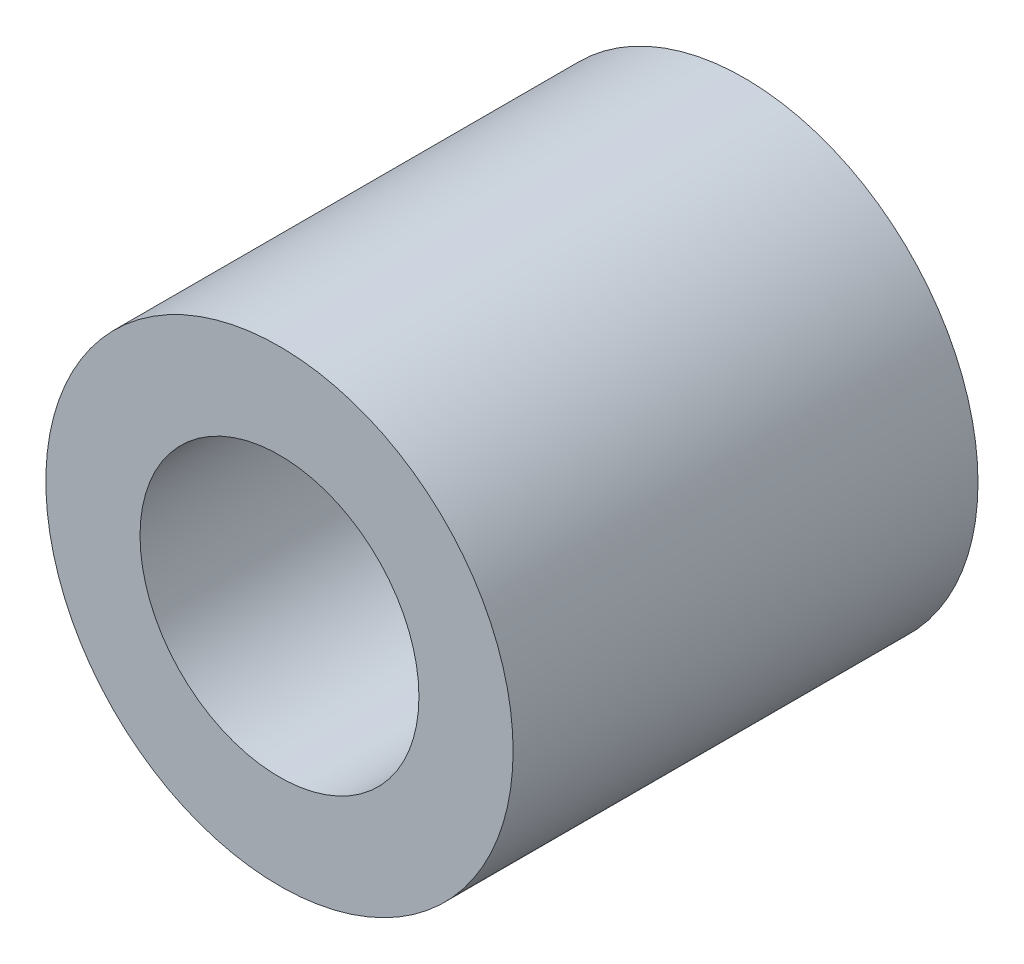
ISO-10303-21;
HEADER;
FILE_DESCRIPTION(('STEP AP214'),'2;1');
FILE_NAME('part.step','',(''),(''),'','','');
FILE_SCHEMA(('AUTOMOTIVE_DESIGN { 1 0 10303 214 1 1 1 1 }'));
ENDSEC;
DATA;
#1=APPLICATION_CONTEXT('core data for automotive mechanical design processes');
#2=APPLICATION_PROTOCOL_DEFINITION('international standard','automotive_design',2000,#1);
#3=PRODUCT_CONTEXT('',#1,'mechanical');
#4=PRODUCT('Part','Part','',(#3));
#5=PRODUCT_RELATED_PRODUCT_CATEGORY('part','',(#4));
#6=PRODUCT_DEFINITION_FORMATION('','',#4);
#7=PRODUCT_DEFINITION_CONTEXT('part definition',#1,'design');
#8=PRODUCT_DEFINITION('design','',#6,#7);
#9=PRODUCT_DEFINITION_SHAPE('','',#8);
#10=(LENGTH_UNIT() NAMED_UNIT(*) SI_UNIT(.MILLI.,.METRE.));
#11=(NAMED_UNIT(*) PLANE_ANGLE_UNIT() SI_UNIT($,.RADIAN.));
#12=(NAMED_UNIT(*) SI_UNIT($,.STERADIAN.) SOLID_ANGLE_UNIT());
#13=UNCERTAINTY_MEASURE_WITH_UNIT(LENGTH_MEASURE(1.E-05),#10,'distance_accuracy_value','');
#14=(GEOMETRIC_REPRESENTATION_CONTEXT(3) GLOBAL_UNCERTAINTY_ASSIGNED_CONTEXT((#13)) GLOBAL_UNIT_ASSIGNED_CONTEXT((#10,
#11,#12)) REPRESENTATION_CONTEXT('',''));
#15=CARTESIAN_POINT('',(0.,0.,0.));
#16=DIRECTION('',(0.,0.,1.));
#17=DIRECTION('',(1.,0.,0.));
#18=AXIS2_PLACEMENT_3D('',#15,#16,#17);
#19=CARTESIAN_POINT('',(0.,0.,5.));
#20=DIRECTION('',(0.,0.,1.));
#21=DIRECTION('',(1.,0.,0.));
#22=AXIS2_PLACEMENT_3D('',#19,#20,#21);
#23=PLANE('',#22);
#24=CARTESIAN_POINT('',(0.,0.,5.));
#25=DIRECTION('',(0.,0.,1.));
#26=DIRECTION('',(1.,0.,0.));
#27=AXIS2_PLACEMENT_3D('',#24,#25,#26);
#28=CIRCLE('',#27,5.0255);
#29=CARTESIAN_POINT('',(5.0255,0.,5.));
#30=VERTEX_POINT('',#29);
#31=EDGE_CURVE('E10',#30,#30,#28,.T.);
#32=ORIENTED_EDGE('',*,*,#31,.T.);
#33=EDGE_LOOP('',(#32));
#34=FACE_BOUND('',#33,.T.);
#35=CARTESIAN_POINT('',(0.,0.,5.));
#36=DIRECTION('',(0.,0.,1.));
#37=DIRECTION('',(1.,0.,0.));
#38=AXIS2_PLACEMENT_3D('',#35,#36,#37);
#39=CIRCLE('',#38,3.);
#40=CARTESIAN_POINT('',(3.,0.,5.));
#41=VERTEX_POINT('',#40);
#42=EDGE_CURVE('E37',#41,#41,#39,.T.);
#43=ORIENTED_EDGE('',*,*,#42,.F.);
#44=EDGE_LOOP('',(#43));
#45=FACE_BOUND('',#44,.T.);
#46=ADVANCED_FACE('F30',(#34,#45),#23,.T.);
#47=CARTESIAN_POINT('',(0.,0.,5.));
#48=DIRECTION('',(0.,0.,-1.));
#49=DIRECTION('',(-1.,0.,0.));
#50=AXIS2_PLACEMENT_3D('',#47,#48,#49);
#51=CYLINDRICAL_SURFACE('',#50,5.0255);
#52=ORIENTED_EDGE('',*,*,#31,.F.);
#53=EDGE_LOOP('',(#52));
#54=FACE_BOUND('',#53,.T.);
#55=CARTESIAN_POINT('',(0.,0.,-5.));
#56=DIRECTION('',(0.,0.,1.));
#57=DIRECTION('',(1.,0.,0.));
#58=AXIS2_PLACEMENT_3D('',#55,#56,#57);
#59=CIRCLE('',#58,5.0255);
#60=CARTESIAN_POINT('',(5.0255,0.,-5.));
#61=VERTEX_POINT('',#60);
#62=EDGE_CURVE('E41',#61,#61,#59,.T.);
#63=ORIENTED_EDGE('',*,*,#62,.T.);
#64=EDGE_LOOP('',(#63));
#65=FACE_BOUND('',#64,.T.);
#66=ADVANCED_FACE('F32',(#54,#65),#51,.T.);
#67=CARTESIAN_POINT('',(0.,0.,5.));
#68=DIRECTION('',(0.,0.,-1.));
#69=DIRECTION('',(-1.,0.,0.));
#70=AXIS2_PLACEMENT_3D('',#67,#68,#69);
#71=CYLINDRICAL_SURFACE('',#70,3.);
#72=ORIENTED_EDGE('',*,*,#42,.T.);
#73=EDGE_LOOP('',(#72));
#74=FACE_BOUND('',#73,.T.);
#75=CARTESIAN_POINT('',(0.,0.,-5.));
#76=DIRECTION('',(0.,0.,1.));
#77=DIRECTION('',(1.,0.,0.));
#78=AXIS2_PLACEMENT_3D('',#75,#76,#77);
#79=CIRCLE('',#78,3.);
#80=CARTESIAN_POINT('',(3.,0.,-5.));
#81=VERTEX_POINT('',#80);
#82=EDGE_CURVE('E45',#81,#81,#79,.T.);
#83=ORIENTED_EDGE('',*,*,#82,.F.);
#84=EDGE_LOOP('',(#83));
#85=FACE_BOUND('',#84,.T.);
#86=ADVANCED_FACE('F54',(#74,#85),#71,.F.);
#87=CARTESIAN_POINT('',(0.,0.,-5.));
#88=DIRECTION('',(0.,0.,1.));
#89=DIRECTION('',(1.,0.,0.));
#90=AXIS2_PLACEMENT_3D('',#87,#88,#89);
#91=PLANE('',#90);
#92=ORIENTED_EDGE('',*,*,#82,.T.);
#93=EDGE_LOOP('',(#92));
#94=FACE_BOUND('',#93,.T.);
#95=ORIENTED_EDGE('',*,*,#62,.F.);
#96=EDGE_LOOP('',(#95));
#97=FACE_BOUND('',#96,.T.);
#98=ADVANCED_FACE('F51',(#94,#97),#91,.F.);
#99=CLOSED_SHELL('',(#46,#66,#86,#98));
#100=MANIFOLD_SOLID_BREP('B2',#99);
#101=ADVANCED_BREP_SHAPE_REPRESENTATION('',(#18,#100),#14);
#102=SHAPE_DEFINITION_REPRESENTATION(#9,#101);
ENDSEC;
END-ISO-10303-21;
